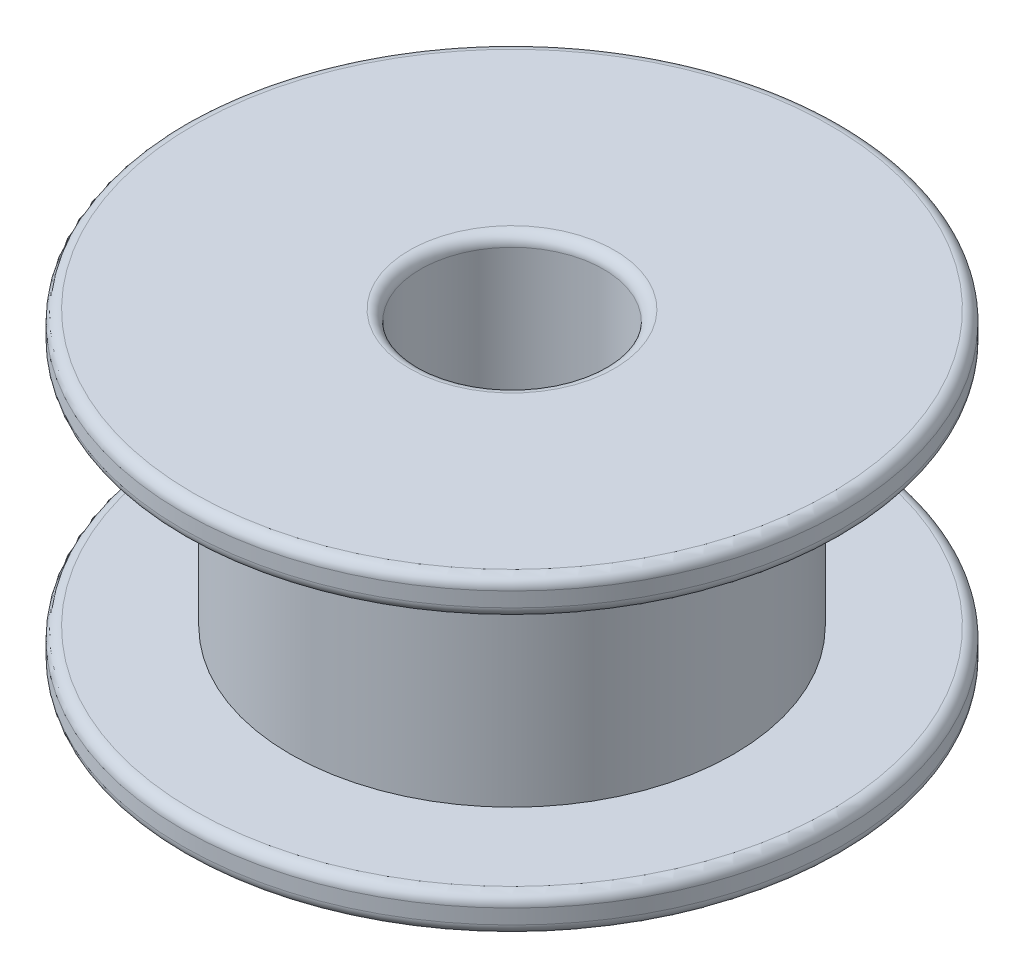
ISO-10303-21;
HEADER;
FILE_DESCRIPTION(('STEP AP214'),'2;1');
FILE_NAME('part.step','',(''),(''),'','','');
FILE_SCHEMA(('AUTOMOTIVE_DESIGN { 1 0 10303 214 1 1 1 1 }'));
ENDSEC;
DATA;
#1=APPLICATION_CONTEXT('core data for automotive mechanical design processes');
#2=APPLICATION_PROTOCOL_DEFINITION('international standard','automotive_design',2000,#1);
#3=PRODUCT_CONTEXT('',#1,'mechanical');
#4=PRODUCT('Part','Part','',(#3));
#5=PRODUCT_RELATED_PRODUCT_CATEGORY('part','',(#4));
#6=PRODUCT_DEFINITION_FORMATION('','',#4);
#7=PRODUCT_DEFINITION_CONTEXT('part definition',#1,'design');
#8=PRODUCT_DEFINITION('design','',#6,#7);
#9=PRODUCT_DEFINITION_SHAPE('','',#8);
#10=(LENGTH_UNIT() NAMED_UNIT(*) SI_UNIT(.MILLI.,.METRE.));
#11=(NAMED_UNIT(*) PLANE_ANGLE_UNIT() SI_UNIT($,.RADIAN.));
#12=(NAMED_UNIT(*) SI_UNIT($,.STERADIAN.) SOLID_ANGLE_UNIT());
#13=UNCERTAINTY_MEASURE_WITH_UNIT(LENGTH_MEASURE(1.E-05),#10,'distance_accuracy_value','');
#14=(GEOMETRIC_REPRESENTATION_CONTEXT(3) GLOBAL_UNCERTAINTY_ASSIGNED_CONTEXT((#13)) GLOBAL_UNIT_ASSIGNED_CONTEXT((#10,
#11,#12)) REPRESENTATION_CONTEXT('',''));
#15=CARTESIAN_POINT('',(0.,0.,0.));
#16=DIRECTION('',(0.,0.,1.));
#17=DIRECTION('',(1.,0.,0.));
#18=AXIS2_PLACEMENT_3D('',#15,#16,#17);
#19=CARTESIAN_POINT('',(0.,1.,0.));
#20=DIRECTION('',(0.,1.,0.));
#21=DIRECTION('',(0.,0.,1.));
#22=AXIS2_PLACEMENT_3D('',#19,#20,#21);
#23=PLANE('',#22);
#24=CARTESIAN_POINT('',(0.,1.,0.));
#25=DIRECTION('',(0.,1.,0.));
#26=DIRECTION('',(0.,0.,1.));
#27=AXIS2_PLACEMENT_3D('',#24,#25,#26);
#28=CIRCLE('',#27,8.7);
#29=CARTESIAN_POINT('',(0.,1.,8.7));
#30=VERTEX_POINT('',#29);
#31=EDGE_CURVE('E10',#30,#30,#28,.T.);
#32=ORIENTED_EDGE('',*,*,#31,.T.);
#33=EDGE_LOOP('',(#32));
#34=FACE_BOUND('',#33,.T.);
#35=CARTESIAN_POINT('',(0.,1.,0.));
#36=DIRECTION('',(0.,1.,0.));
#37=DIRECTION('',(0.,0.,1.));
#38=AXIS2_PLACEMENT_3D('',#35,#36,#37);
#39=CIRCLE('',#38,6.05);
#40=CARTESIAN_POINT('',(0.,1.,6.05));
#41=VERTEX_POINT('',#40);
#42=EDGE_CURVE('E76',#41,#41,#39,.T.);
#43=ORIENTED_EDGE('',*,*,#42,.F.);
#44=EDGE_LOOP('',(#43));
#45=FACE_BOUND('',#44,.T.);
#46=ADVANCED_FACE('F31',(#34,#45),#23,.T.);
#47=CARTESIAN_POINT('',(0.,0.,0.));
#48=DIRECTION('',(0.,1.,0.));
#49=DIRECTION('',(0.,0.,1.));
#50=AXIS2_PLACEMENT_3D('',#47,#48,#49);
#51=PLANE('',#50);
#52=CARTESIAN_POINT('',(0.,0.,0.));
#53=DIRECTION('',(0.,1.,0.));
#54=DIRECTION('',(0.,0.,1.));
#55=AXIS2_PLACEMENT_3D('',#52,#53,#54);
#56=CIRCLE('',#55,2.8);
#57=CARTESIAN_POINT('',(0.,0.,2.8));
#58=VERTEX_POINT('',#57);
#59=EDGE_CURVE('E69',#58,#58,#56,.T.);
#60=ORIENTED_EDGE('',*,*,#59,.T.);
#61=EDGE_LOOP('',(#60));
#62=FACE_BOUND('',#61,.T.);
#63=CARTESIAN_POINT('',(0.,0.,0.));
#64=DIRECTION('',(0.,1.,0.));
#65=DIRECTION('',(0.,0.,1.));
#66=AXIS2_PLACEMENT_3D('',#63,#64,#65);
#67=CIRCLE('',#66,8.7);
#68=CARTESIAN_POINT('',(0.,0.,8.7));
#69=VERTEX_POINT('',#68);
#70=EDGE_CURVE('E72',#69,#69,#67,.F.);
#71=ORIENTED_EDGE('',*,*,#70,.T.);
#72=EDGE_LOOP('',(#71));
#73=FACE_BOUND('',#72,.T.);
#74=ADVANCED_FACE('F93',(#62,#73),#51,.F.);
#75=CARTESIAN_POINT('',(0.,1.,0.));
#76=DIRECTION('',(0.,-1.,0.));
#77=DIRECTION('',(0.,0.,-1.));
#78=AXIS2_PLACEMENT_3D('',#75,#76,#77);
#79=CYLINDRICAL_SURFACE('',#78,9.);
#80=CARTESIAN_POINT('',(0.,0.3,0.));
#81=DIRECTION('',(0.,1.,0.));
#82=DIRECTION('',(0.,0.,1.));
#83=AXIS2_PLACEMENT_3D('',#80,#81,#82);
#84=CIRCLE('',#83,9.);
#85=CARTESIAN_POINT('',(0.,0.3,9.));
#86=VERTEX_POINT('',#85);
#87=EDGE_CURVE('E57',#86,#86,#84,.T.);
#88=ORIENTED_EDGE('',*,*,#87,.T.);
#89=EDGE_LOOP('',(#88));
#90=FACE_BOUND('',#89,.T.);
#91=CARTESIAN_POINT('',(0.,0.7,0.));
#92=DIRECTION('',(0.,1.,0.));
#93=DIRECTION('',(0.,0.,1.));
#94=AXIS2_PLACEMENT_3D('',#91,#92,#93);
#95=CIRCLE('',#94,9.);
#96=CARTESIAN_POINT('',(0.,0.7,9.));
#97=VERTEX_POINT('',#96);
#98=EDGE_CURVE('E60',#97,#97,#95,.F.);
#99=ORIENTED_EDGE('',*,*,#98,.T.);
#100=EDGE_LOOP('',(#99));
#101=FACE_BOUND('',#100,.T.);
#102=ADVANCED_FACE('F98',(#90,#101),#79,.T.);
#103=CARTESIAN_POINT('',(0.,1.,0.));
#104=DIRECTION('',(0.,-1.,0.));
#105=DIRECTION('',(0.,0.,-1.));
#106=AXIS2_PLACEMENT_3D('',#103,#104,#105);
#107=CYLINDRICAL_SURFACE('',#106,2.5);
#108=CARTESIAN_POINT('',(0.,0.3,0.));
#109=DIRECTION('',(0.,1.,0.));
#110=DIRECTION('',(0.,0.,1.));
#111=AXIS2_PLACEMENT_3D('',#108,#109,#110);
#112=CIRCLE('',#111,2.5);
#113=CARTESIAN_POINT('',(0.,0.3,2.5));
#114=VERTEX_POINT('',#113);
#115=EDGE_CURVE('E63',#114,#114,#112,.F.);
#116=ORIENTED_EDGE('',*,*,#115,.T.);
#117=EDGE_LOOP('',(#116));
#118=FACE_BOUND('',#117,.T.);
#119=CARTESIAN_POINT('',(0.,8.2,0.));
#120=DIRECTION('',(0.,1.,0.));
#121=DIRECTION('',(0.,0.,1.));
#122=AXIS2_PLACEMENT_3D('',#119,#120,#121);
#123=CIRCLE('',#122,2.5);
#124=CARTESIAN_POINT('',(0.,8.2,2.5));
#125=VERTEX_POINT('',#124);
#126=EDGE_CURVE('E66',#125,#125,#123,.T.);
#127=ORIENTED_EDGE('',*,*,#126,.T.);
#128=EDGE_LOOP('',(#127));
#129=FACE_BOUND('',#128,.T.);
#130=ADVANCED_FACE('F88',(#118,#129),#107,.F.);
#131=CARTESIAN_POINT('',(0.,7.5,0.));
#132=DIRECTION('',(0.,-1.,0.));
#133=DIRECTION('',(0.,0.,-1.));
#134=AXIS2_PLACEMENT_3D('',#131,#132,#133);
#135=CYLINDRICAL_SURFACE('',#134,6.05);
#136=CARTESIAN_POINT('',(0.,7.5,0.));
#137=DIRECTION('',(0.,1.,0.));
#138=DIRECTION('',(0.,0.,1.));
#139=AXIS2_PLACEMENT_3D('',#136,#137,#138);
#140=CIRCLE('',#139,6.05);
#141=CARTESIAN_POINT('',(0.,7.5,6.05));
#142=VERTEX_POINT('',#141);
#143=EDGE_CURVE('E75',#142,#142,#140,.T.);
#144=ORIENTED_EDGE('',*,*,#143,.F.);
#145=EDGE_LOOP('',(#144));
#146=FACE_BOUND('',#145,.T.);
#147=ORIENTED_EDGE('',*,*,#42,.T.);
#148=EDGE_LOOP('',(#147));
#149=FACE_BOUND('',#148,.T.);
#150=ADVANCED_FACE('F84',(#146,#149),#135,.T.);
#151=CARTESIAN_POINT('',(0.,8.5,0.));
#152=DIRECTION('',(0.,1.,0.));
#153=DIRECTION('',(0.,0.,1.));
#154=AXIS2_PLACEMENT_3D('',#151,#152,#153);
#155=PLANE('',#154);
#156=CARTESIAN_POINT('',(0.,8.5,0.));
#157=DIRECTION('',(0.,1.,0.));
#158=DIRECTION('',(0.,0.,1.));
#159=AXIS2_PLACEMENT_3D('',#156,#157,#158);
#160=CIRCLE('',#159,2.8);
#161=CARTESIAN_POINT('',(0.,8.5,2.8));
#162=VERTEX_POINT('',#161);
#163=EDGE_CURVE('E51',#162,#162,#160,.F.);
#164=ORIENTED_EDGE('',*,*,#163,.T.);
#165=EDGE_LOOP('',(#164));
#166=FACE_BOUND('',#165,.T.);
#167=CARTESIAN_POINT('',(0.,8.5,0.));
#168=DIRECTION('',(0.,1.,0.));
#169=DIRECTION('',(0.,0.,1.));
#170=AXIS2_PLACEMENT_3D('',#167,#168,#169);
#171=CIRCLE('',#170,8.7);
#172=CARTESIAN_POINT('',(0.,8.5,8.7));
#173=VERTEX_POINT('',#172);
#174=EDGE_CURVE('E54',#173,#173,#171,.T.);
#175=ORIENTED_EDGE('',*,*,#174,.T.);
#176=EDGE_LOOP('',(#175));
#177=FACE_BOUND('',#176,.T.);
#178=ADVANCED_FACE('F87',(#166,#177),#155,.T.);
#179=CARTESIAN_POINT('',(0.,7.5,0.));
#180=DIRECTION('',(0.,1.,0.));
#181=DIRECTION('',(0.,0.,1.));
#182=AXIS2_PLACEMENT_3D('',#179,#180,#181);
#183=PLANE('',#182);
#184=CARTESIAN_POINT('',(0.,7.5,0.));
#185=DIRECTION('',(0.,1.,0.));
#186=DIRECTION('',(0.,0.,1.));
#187=AXIS2_PLACEMENT_3D('',#184,#185,#186);
#188=CIRCLE('',#187,8.7);
#189=CARTESIAN_POINT('',(0.,7.5,8.7));
#190=VERTEX_POINT('',#189);
#191=EDGE_CURVE('E38',#190,#190,#188,.F.);
#192=ORIENTED_EDGE('',*,*,#191,.T.);
#193=EDGE_LOOP('',(#192));
#194=FACE_BOUND('',#193,.T.);
#195=ORIENTED_EDGE('',*,*,#143,.T.);
#196=EDGE_LOOP('',(#195));
#197=FACE_BOUND('',#196,.T.);
#198=ADVANCED_FACE('F82',(#194,#197),#183,.F.);
#199=CARTESIAN_POINT('',(0.,8.5,0.));
#200=DIRECTION('',(0.,-1.,0.));
#201=DIRECTION('',(0.,0.,-1.));
#202=AXIS2_PLACEMENT_3D('',#199,#200,#201);
#203=CYLINDRICAL_SURFACE('',#202,9.);
#204=CARTESIAN_POINT('',(0.,8.2,0.));
#205=DIRECTION('',(0.,1.,0.));
#206=DIRECTION('',(0.,0.,1.));
#207=AXIS2_PLACEMENT_3D('',#204,#205,#206);
#208=CIRCLE('',#207,9.);
#209=CARTESIAN_POINT('',(0.,8.2,9.));
#210=VERTEX_POINT('',#209);
#211=EDGE_CURVE('E42',#210,#210,#208,.F.);
#212=ORIENTED_EDGE('',*,*,#211,.T.);
#213=EDGE_LOOP('',(#212));
#214=FACE_BOUND('',#213,.T.);
#215=CARTESIAN_POINT('',(0.,7.8,0.));
#216=DIRECTION('',(0.,1.,0.));
#217=DIRECTION('',(0.,0.,1.));
#218=AXIS2_PLACEMENT_3D('',#215,#216,#217);
#219=CIRCLE('',#218,9.);
#220=CARTESIAN_POINT('',(0.,7.8,9.));
#221=VERTEX_POINT('',#220);
#222=EDGE_CURVE('E46',#221,#221,#219,.T.);
#223=ORIENTED_EDGE('',*,*,#222,.T.);
#224=EDGE_LOOP('',(#223));
#225=FACE_BOUND('',#224,.T.);
#226=ADVANCED_FACE('F110',(#214,#225),#203,.T.);
#227=CARTESIAN_POINT('',(0.,0.3,0.));
#228=DIRECTION('',(0.,1.,0.));
#229=DIRECTION('',(0.,0.,1.));
#230=AXIS2_PLACEMENT_3D('',#227,#228,#229);
#231=TOROIDAL_SURFACE('',#230,2.8,0.3);
#232=ORIENTED_EDGE('',*,*,#115,.F.);
#233=EDGE_LOOP('',(#232));
#234=FACE_BOUND('',#233,.T.);
#235=ORIENTED_EDGE('',*,*,#59,.F.);
#236=EDGE_LOOP('',(#235));
#237=FACE_BOUND('',#236,.T.);
#238=ADVANCED_FACE('F106',(#234,#237),#231,.T.);
#239=CARTESIAN_POINT('',(0.,0.3,0.));
#240=DIRECTION('',(0.,1.,0.));
#241=DIRECTION('',(0.,0.,1.));
#242=AXIS2_PLACEMENT_3D('',#239,#240,#241);
#243=TOROIDAL_SURFACE('',#242,8.7,0.3);
#244=ORIENTED_EDGE('',*,*,#70,.F.);
#245=EDGE_LOOP('',(#244));
#246=FACE_BOUND('',#245,.T.);
#247=ORIENTED_EDGE('',*,*,#87,.F.);
#248=EDGE_LOOP('',(#247));
#249=FACE_BOUND('',#248,.T.);
#250=ADVANCED_FACE('F109',(#246,#249),#243,.T.);
#251=CARTESIAN_POINT('',(0.,8.2,0.));
#252=DIRECTION('',(0.,1.,0.));
#253=DIRECTION('',(0.,0.,1.));
#254=AXIS2_PLACEMENT_3D('',#251,#252,#253);
#255=TOROIDAL_SURFACE('',#254,2.8,0.3);
#256=ORIENTED_EDGE('',*,*,#163,.F.);
#257=EDGE_LOOP('',(#256));
#258=FACE_BOUND('',#257,.T.);
#259=ORIENTED_EDGE('',*,*,#126,.F.);
#260=EDGE_LOOP('',(#259));
#261=FACE_BOUND('',#260,.T.);
#262=ADVANCED_FACE('F114',(#258,#261),#255,.T.);
#263=CARTESIAN_POINT('',(0.,8.2,0.));
#264=DIRECTION('',(0.,1.,0.));
#265=DIRECTION('',(0.,0.,1.));
#266=AXIS2_PLACEMENT_3D('',#263,#264,#265);
#267=TOROIDAL_SURFACE('',#266,8.7,0.3);
#268=ORIENTED_EDGE('',*,*,#211,.F.);
#269=EDGE_LOOP('',(#268));
#270=FACE_BOUND('',#269,.T.);
#271=ORIENTED_EDGE('',*,*,#174,.F.);
#272=EDGE_LOOP('',(#271));
#273=FACE_BOUND('',#272,.T.);
#274=ADVANCED_FACE('F118',(#270,#273),#267,.T.);
#275=CARTESIAN_POINT('',(0.,7.8,0.));
#276=DIRECTION('',(0.,1.,0.));
#277=DIRECTION('',(0.,0.,1.));
#278=AXIS2_PLACEMENT_3D('',#275,#276,#277);
#279=TOROIDAL_SURFACE('',#278,8.7,0.3);
#280=ORIENTED_EDGE('',*,*,#191,.F.);
#281=EDGE_LOOP('',(#280));
#282=FACE_BOUND('',#281,.T.);
#283=ORIENTED_EDGE('',*,*,#222,.F.);
#284=EDGE_LOOP('',(#283));
#285=FACE_BOUND('',#284,.T.);
#286=ADVANCED_FACE('F121',(#282,#285),#279,.T.);
#287=CARTESIAN_POINT('',(0.,0.7,0.));
#288=DIRECTION('',(0.,1.,0.));
#289=DIRECTION('',(0.,0.,1.));
#290=AXIS2_PLACEMENT_3D('',#287,#288,#289);
#291=TOROIDAL_SURFACE('',#290,8.7,0.3);
#292=ORIENTED_EDGE('',*,*,#98,.F.);
#293=EDGE_LOOP('',(#292));
#294=FACE_BOUND('',#293,.T.);
#295=ORIENTED_EDGE('',*,*,#31,.F.);
#296=EDGE_LOOP('',(#295));
#297=FACE_BOUND('',#296,.T.);
#298=ADVANCED_FACE('F33',(#294,#297),#291,.T.);
#299=CLOSED_SHELL('',(#46,#74,#102,#130,#150,#178,#198,#226,#238,#250,#262,#274,#286,#298));
#300=MANIFOLD_SOLID_BREP('B2',#299);
#301=ADVANCED_BREP_SHAPE_REPRESENTATION('',(#18,#300),#14);
#302=SHAPE_DEFINITION_REPRESENTATION(#9,#301);
ENDSEC;
END-ISO-10303-21;
